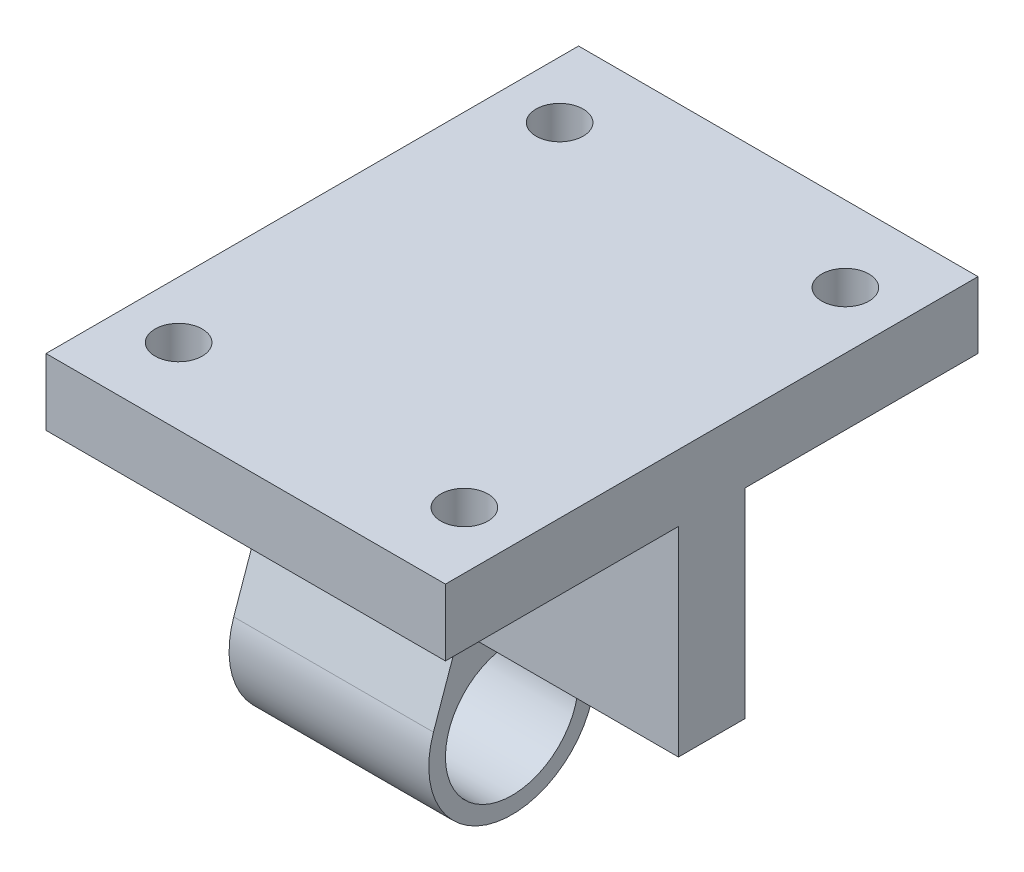
ISO-10303-21;
HEADER;
FILE_DESCRIPTION(('STEP AP214'),'2;1');
FILE_NAME('part.step','',(''),(''),'','','');
FILE_SCHEMA(('AUTOMOTIVE_DESIGN { 1 0 10303 214 1 1 1 1 }'));
ENDSEC;
DATA;
#1=APPLICATION_CONTEXT('core data for automotive mechanical design processes');
#2=APPLICATION_PROTOCOL_DEFINITION('international standard','automotive_design',2000,#1);
#3=PRODUCT_CONTEXT('',#1,'mechanical');
#4=PRODUCT('Part','Part','',(#3));
#5=PRODUCT_RELATED_PRODUCT_CATEGORY('part','',(#4));
#6=PRODUCT_DEFINITION_FORMATION('','',#4);
#7=PRODUCT_DEFINITION_CONTEXT('part definition',#1,'design');
#8=PRODUCT_DEFINITION('design','',#6,#7);
#9=PRODUCT_DEFINITION_SHAPE('','',#8);
#10=(LENGTH_UNIT() NAMED_UNIT(*) SI_UNIT(.MILLI.,.METRE.));
#11=(NAMED_UNIT(*) PLANE_ANGLE_UNIT() SI_UNIT($,.RADIAN.));
#12=(NAMED_UNIT(*) SI_UNIT($,.STERADIAN.) SOLID_ANGLE_UNIT());
#13=UNCERTAINTY_MEASURE_WITH_UNIT(LENGTH_MEASURE(1.E-05),#10,'distance_accuracy_value','');
#14=(GEOMETRIC_REPRESENTATION_CONTEXT(3) GLOBAL_UNCERTAINTY_ASSIGNED_CONTEXT((#13)) GLOBAL_UNIT_ASSIGNED_CONTEXT((#10,
#11,#12)) REPRESENTATION_CONTEXT('',''));
#15=CARTESIAN_POINT('',(0.,0.,0.));
#16=DIRECTION('',(0.,0.,1.));
#17=DIRECTION('',(1.,0.,0.));
#18=AXIS2_PLACEMENT_3D('',#15,#16,#17);
#19=CARTESIAN_POINT('',(38.1,19.05,-3.175));
#20=DIRECTION('',(0.,0.,1.));
#21=DIRECTION('',(0.,-1.,0.));
#22=AXIS2_PLACEMENT_3D('',#19,#20,#21);
#23=PLANE('',#22);
#24=DIRECTION('',(-1.,0.,0.));
#25=VECTOR('',#24,1.);
#26=CARTESIAN_POINT('',(19.05,8.08321734792888,-3.175));
#27=LINE('',#26,#25);
#28=CARTESIAN_POINT('',(19.05,8.08321734792888,-3.175));
#29=VERTEX_POINT('',#28);
#30=CARTESIAN_POINT('',(0.,8.08321734792888,-3.175));
#31=VERTEX_POINT('',#30);
#32=EDGE_CURVE('E158',#29,#31,#27,.T.);
#33=ORIENTED_EDGE('',*,*,#32,.T.);
#34=DIRECTION('',(0.,1.,0.));
#35=VECTOR('',#34,1.);
#36=CARTESIAN_POINT('',(0.,19.05,-3.175));
#37=LINE('',#36,#35);
#38=CARTESIAN_POINT('',(0.,19.05,-3.175));
#39=VERTEX_POINT('',#38);
#40=EDGE_CURVE('E194',#31,#39,#37,.T.);
#41=ORIENTED_EDGE('',*,*,#40,.T.);
#42=DIRECTION('',(-1.,0.,0.));
#43=VECTOR('',#42,1.);
#44=CARTESIAN_POINT('',(38.1,19.05,-3.175));
#45=LINE('',#44,#43);
#46=CARTESIAN_POINT('',(38.1,19.05,-3.175));
#47=VERTEX_POINT('',#46);
#48=EDGE_CURVE('E11',#47,#39,#45,.T.);
#49=ORIENTED_EDGE('',*,*,#48,.F.);
#50=DIRECTION('',(0.,1.,0.));
#51=VECTOR('',#50,1.);
#52=CARTESIAN_POINT('',(38.1,19.05,-3.175));
#53=LINE('',#52,#51);
#54=CARTESIAN_POINT('',(38.1,0.,-3.175));
#55=VERTEX_POINT('',#54);
#56=EDGE_CURVE('E201',#55,#47,#53,.T.);
#57=ORIENTED_EDGE('',*,*,#56,.F.);
#58=DIRECTION('',(-1.,0.,0.));
#59=VECTOR('',#58,1.);
#60=CARTESIAN_POINT('',(38.1,0.,-3.175));
#61=LINE('',#60,#59);
#62=CARTESIAN_POINT('',(19.05,0.,-3.175));
#63=VERTEX_POINT('',#62);
#64=EDGE_CURVE('E219',#55,#63,#61,.T.);
#65=ORIENTED_EDGE('',*,*,#64,.T.);
#66=DIRECTION('',(0.,-1.,0.));
#67=VECTOR('',#66,1.);
#68=CARTESIAN_POINT('',(19.05,0.,-3.175));
#69=LINE('',#68,#67);
#70=EDGE_CURVE('E51',#29,#63,#69,.T.);
#71=ORIENTED_EDGE('',*,*,#70,.F.);
#72=EDGE_LOOP('',(#33,#41,#49,#57,#65,#71));
#73=FACE_BOUND('',#72,.T.);
#74=ADVANCED_FACE('F35',(#73),#23,.F.);
#75=CARTESIAN_POINT('',(38.1,19.05,3.175));
#76=DIRECTION('',(0.,0.,-1.));
#77=DIRECTION('',(0.,1.,0.));
#78=AXIS2_PLACEMENT_3D('',#75,#76,#77);
#79=PLANE('',#78);
#80=DIRECTION('',(-1.,0.,0.));
#81=VECTOR('',#80,1.);
#82=CARTESIAN_POINT('',(19.05,8.08321734792888,3.175));
#83=LINE('',#82,#81);
#84=CARTESIAN_POINT('',(19.05,8.08321734792888,3.175));
#85=VERTEX_POINT('',#84);
#86=CARTESIAN_POINT('',(0.,8.08321734792888,3.175));
#87=VERTEX_POINT('',#86);
#88=EDGE_CURVE('E59',#85,#87,#83,.T.);
#89=ORIENTED_EDGE('',*,*,#88,.F.);
#90=DIRECTION('',(0.,1.,0.));
#91=VECTOR('',#90,1.);
#92=CARTESIAN_POINT('',(19.05,0.,3.175));
#93=LINE('',#92,#91);
#94=CARTESIAN_POINT('',(19.05,0.,3.175));
#95=VERTEX_POINT('',#94);
#96=EDGE_CURVE('E172',#95,#85,#93,.T.);
#97=ORIENTED_EDGE('',*,*,#96,.F.);
#98=DIRECTION('',(-1.,0.,0.));
#99=VECTOR('',#98,1.);
#100=CARTESIAN_POINT('',(38.1,0.,3.175));
#101=LINE('',#100,#99);
#102=CARTESIAN_POINT('',(38.1,0.,3.175));
#103=VERTEX_POINT('',#102);
#104=EDGE_CURVE('E233',#103,#95,#101,.T.);
#105=ORIENTED_EDGE('',*,*,#104,.F.);
#106=DIRECTION('',(0.,-1.,0.));
#107=VECTOR('',#106,1.);
#108=CARTESIAN_POINT('',(38.1,19.05,3.175));
#109=LINE('',#108,#107);
#110=CARTESIAN_POINT('',(38.1,19.05,3.175));
#111=VERTEX_POINT('',#110);
#112=EDGE_CURVE('E215',#111,#103,#109,.T.);
#113=ORIENTED_EDGE('',*,*,#112,.F.);
#114=DIRECTION('',(-1.,0.,0.));
#115=VECTOR('',#114,1.);
#116=CARTESIAN_POINT('',(38.1,19.05,3.175));
#117=LINE('',#116,#115);
#118=CARTESIAN_POINT('',(0.,19.05,3.175));
#119=VERTEX_POINT('',#118);
#120=EDGE_CURVE('E236',#111,#119,#117,.T.);
#121=ORIENTED_EDGE('',*,*,#120,.T.);
#122=DIRECTION('',(0.,-1.,0.));
#123=VECTOR('',#122,1.);
#124=CARTESIAN_POINT('',(0.,19.05,3.175));
#125=LINE('',#124,#123);
#126=EDGE_CURVE('E205',#119,#87,#125,.T.);
#127=ORIENTED_EDGE('',*,*,#126,.T.);
#128=EDGE_LOOP('',(#89,#97,#105,#113,#121,#127));
#129=FACE_BOUND('',#128,.T.);
#130=ADVANCED_FACE('F300',(#129),#79,.F.);
#131=CARTESIAN_POINT('',(38.1,0.,3.175));
#132=DIRECTION('',(0.,1.,0.));
#133=DIRECTION('',(0.,0.,1.));
#134=AXIS2_PLACEMENT_3D('',#131,#132,#133);
#135=PLANE('',#134);
#136=DIRECTION('',(0.,0.,1.));
#137=VECTOR('',#136,1.);
#138=CARTESIAN_POINT('',(19.05,0.,0.));
#139=LINE('',#138,#137);
#140=EDGE_CURVE('E174',#63,#95,#139,.T.);
#141=ORIENTED_EDGE('',*,*,#140,.F.);
#142=ORIENTED_EDGE('',*,*,#64,.F.);
#143=DIRECTION('',(0.,0.,-1.));
#144=VECTOR('',#143,1.);
#145=CARTESIAN_POINT('',(38.1,0.,3.175));
#146=LINE('',#145,#144);
#147=EDGE_CURVE('E217',#103,#55,#146,.T.);
#148=ORIENTED_EDGE('',*,*,#147,.F.);
#149=ORIENTED_EDGE('',*,*,#104,.T.);
#150=EDGE_LOOP('',(#141,#142,#148,#149));
#151=FACE_BOUND('',#150,.T.);
#152=ADVANCED_FACE('F304',(#151),#135,.F.);
#153=CARTESIAN_POINT('',(38.1,19.05,-3.175));
#154=DIRECTION('',(0.,1.,0.));
#155=DIRECTION('',(0.,0.,1.));
#156=AXIS2_PLACEMENT_3D('',#153,#154,#155);
#157=PLANE('',#156);
#158=CARTESIAN_POINT('',(32.6771,19.0500000000001,-18.1694666666667));
#159=DIRECTION('',(0.,1.,0.));
#160=DIRECTION('',(0.,0.,1.));
#161=AXIS2_PLACEMENT_3D('',#158,#159,#160);
#162=CIRCLE('',#161,2.2479);
#163=CARTESIAN_POINT('',(32.6771,19.05,-15.9215666666667));
#164=VERTEX_POINT('',#163);
#165=EDGE_CURVE('E181',#164,#164,#162,.T.);
#166=ORIENTED_EDGE('',*,*,#165,.T.);
#167=EDGE_LOOP('',(#166));
#168=FACE_BOUND('',#167,.T.);
#169=CARTESIAN_POINT('',(5.4229,19.0500000000001,-18.1694666666667));
#170=DIRECTION('',(0.,1.,0.));
#171=DIRECTION('',(0.,0.,1.));
#172=AXIS2_PLACEMENT_3D('',#169,#170,#171);
#173=CIRCLE('',#172,2.2479);
#174=CARTESIAN_POINT('',(5.4229,19.05,-15.9215666666667));
#175=VERTEX_POINT('',#174);
#176=EDGE_CURVE('E255',#175,#175,#173,.T.);
#177=ORIENTED_EDGE('',*,*,#176,.T.);
#178=EDGE_LOOP('',(#177));
#179=FACE_BOUND('',#178,.T.);
#180=DIRECTION('',(0.,0.,-1.));
#181=VECTOR('',#180,1.);
#182=CARTESIAN_POINT('',(0.,19.05,-3.175));
#183=LINE('',#182,#181);
#184=CARTESIAN_POINT('',(0.,19.0500000000001,-25.4));
#185=VERTEX_POINT('',#184);
#186=EDGE_CURVE('E221',#39,#185,#183,.T.);
#187=ORIENTED_EDGE('',*,*,#186,.T.);
#188=DIRECTION('',(-1.,0.,0.));
#189=VECTOR('',#188,1.);
#190=CARTESIAN_POINT('',(38.1,19.0500000000001,-25.4));
#191=LINE('',#190,#189);
#192=CARTESIAN_POINT('',(38.1,19.0500000000001,-25.4));
#193=VERTEX_POINT('',#192);
#194=EDGE_CURVE('E43',#193,#185,#191,.T.);
#195=ORIENTED_EDGE('',*,*,#194,.F.);
#196=DIRECTION('',(0.,0.,-1.));
#197=VECTOR('',#196,1.);
#198=CARTESIAN_POINT('',(38.1,19.05,-3.175));
#199=LINE('',#198,#197);
#200=EDGE_CURVE('E204',#47,#193,#199,.T.);
#201=ORIENTED_EDGE('',*,*,#200,.F.);
#202=ORIENTED_EDGE('',*,*,#48,.T.);
#203=EDGE_LOOP('',(#187,#195,#201,#202));
#204=FACE_BOUND('',#203,.T.);
#205=ADVANCED_FACE('F312',(#168,#179,#204),#157,.F.);
#206=CARTESIAN_POINT('',(38.1,25.4000000000001,-25.4));
#207=DIRECTION('',(0.,0.,1.));
#208=DIRECTION('',(0.,-1.,0.));
#209=AXIS2_PLACEMENT_3D('',#206,#207,#208);
#210=PLANE('',#209);
#211=DIRECTION('',(0.,1.,0.));
#212=VECTOR('',#211,1.);
#213=CARTESIAN_POINT('',(0.,25.4000000000001,-25.4));
#214=LINE('',#213,#212);
#215=CARTESIAN_POINT('',(0.,25.4000000000001,-25.4));
#216=VERTEX_POINT('',#215);
#217=EDGE_CURVE('E223',#185,#216,#214,.T.);
#218=ORIENTED_EDGE('',*,*,#217,.T.);
#219=DIRECTION('',(-1.,0.,0.));
#220=VECTOR('',#219,1.);
#221=CARTESIAN_POINT('',(38.1,25.4000000000001,-25.4));
#222=LINE('',#221,#220);
#223=CARTESIAN_POINT('',(38.1,25.4000000000001,-25.4));
#224=VERTEX_POINT('',#223);
#225=EDGE_CURVE('E245',#224,#216,#222,.T.);
#226=ORIENTED_EDGE('',*,*,#225,.F.);
#227=DIRECTION('',(0.,1.,0.));
#228=VECTOR('',#227,1.);
#229=CARTESIAN_POINT('',(38.1,25.4000000000001,-25.4));
#230=LINE('',#229,#228);
#231=EDGE_CURVE('E207',#193,#224,#230,.T.);
#232=ORIENTED_EDGE('',*,*,#231,.F.);
#233=ORIENTED_EDGE('',*,*,#194,.T.);
#234=EDGE_LOOP('',(#218,#226,#232,#233));
#235=FACE_BOUND('',#234,.T.);
#236=ADVANCED_FACE('F344',(#235),#210,.F.);
#237=CARTESIAN_POINT('',(38.1,25.4000000000001,25.4));
#238=DIRECTION('',(0.,-1.,0.));
#239=DIRECTION('',(0.,0.,-1.));
#240=AXIS2_PLACEMENT_3D('',#237,#238,#239);
#241=PLANE('',#240);
#242=CARTESIAN_POINT('',(5.4229,25.4000000000001,18.1694666666667));
#243=DIRECTION('',(0.,1.,0.));
#244=DIRECTION('',(0.,0.,1.));
#245=AXIS2_PLACEMENT_3D('',#242,#243,#244);
#246=CIRCLE('',#245,2.2479);
#247=CARTESIAN_POINT('',(5.4229,25.4000000000001,20.4173666666667));
#248=VERTEX_POINT('',#247);
#249=EDGE_CURVE('E266',#248,#248,#246,.T.);
#250=ORIENTED_EDGE('',*,*,#249,.F.);
#251=EDGE_LOOP('',(#250));
#252=FACE_BOUND('',#251,.T.);
#253=CARTESIAN_POINT('',(32.6771,25.4000000000001,18.1694666666667));
#254=DIRECTION('',(0.,1.,0.));
#255=DIRECTION('',(0.,0.,1.));
#256=AXIS2_PLACEMENT_3D('',#253,#254,#255);
#257=CIRCLE('',#256,2.2479);
#258=CARTESIAN_POINT('',(32.6771,25.4000000000001,20.4173666666667));
#259=VERTEX_POINT('',#258);
#260=EDGE_CURVE('E262',#259,#259,#257,.T.);
#261=ORIENTED_EDGE('',*,*,#260,.F.);
#262=EDGE_LOOP('',(#261));
#263=FACE_BOUND('',#262,.T.);
#264=CARTESIAN_POINT('',(32.6771,25.4000000000001,-18.1694666666667));
#265=DIRECTION('',(0.,1.,0.));
#266=DIRECTION('',(0.,0.,1.));
#267=AXIS2_PLACEMENT_3D('',#264,#265,#266);
#268=CIRCLE('',#267,2.2479);
#269=CARTESIAN_POINT('',(32.6771,25.4000000000001,-15.9215666666667));
#270=VERTEX_POINT('',#269);
#271=EDGE_CURVE('E257',#270,#270,#268,.T.);
#272=ORIENTED_EDGE('',*,*,#271,.F.);
#273=EDGE_LOOP('',(#272));
#274=FACE_BOUND('',#273,.T.);
#275=CARTESIAN_POINT('',(5.4229,25.4000000000001,-18.1694666666667));
#276=DIRECTION('',(0.,1.,0.));
#277=DIRECTION('',(0.,0.,1.));
#278=AXIS2_PLACEMENT_3D('',#275,#276,#277);
#279=CIRCLE('',#278,2.2479);
#280=CARTESIAN_POINT('',(5.4229,25.4000000000001,-15.9215666666667));
#281=VERTEX_POINT('',#280);
#282=EDGE_CURVE('E251',#281,#281,#279,.T.);
#283=ORIENTED_EDGE('',*,*,#282,.F.);
#284=EDGE_LOOP('',(#283));
#285=FACE_BOUND('',#284,.T.);
#286=DIRECTION('',(0.,0.,1.));
#287=VECTOR('',#286,1.);
#288=CARTESIAN_POINT('',(0.,25.4000000000001,25.4));
#289=LINE('',#288,#287);
#290=CARTESIAN_POINT('',(0.,25.4000000000001,25.4));
#291=VERTEX_POINT('',#290);
#292=EDGE_CURVE('E225',#216,#291,#289,.T.);
#293=ORIENTED_EDGE('',*,*,#292,.T.);
#294=DIRECTION('',(-1.,0.,0.));
#295=VECTOR('',#294,1.);
#296=CARTESIAN_POINT('',(38.1,25.4000000000001,25.4));
#297=LINE('',#296,#295);
#298=CARTESIAN_POINT('',(38.1,25.4000000000001,25.4));
#299=VERTEX_POINT('',#298);
#300=EDGE_CURVE('E242',#299,#291,#297,.T.);
#301=ORIENTED_EDGE('',*,*,#300,.F.);
#302=DIRECTION('',(0.,0.,1.));
#303=VECTOR('',#302,1.);
#304=CARTESIAN_POINT('',(38.1,25.4000000000001,25.4));
#305=LINE('',#304,#303);
#306=EDGE_CURVE('E209',#224,#299,#305,.T.);
#307=ORIENTED_EDGE('',*,*,#306,.F.);
#308=ORIENTED_EDGE('',*,*,#225,.T.);
#309=EDGE_LOOP('',(#293,#301,#307,#308));
#310=FACE_BOUND('',#309,.T.);
#311=ADVANCED_FACE('F339',(#252,#263,#274,#285,#310),#241,.F.);
#312=CARTESIAN_POINT('',(38.1,25.4000000000001,25.4));
#313=DIRECTION('',(0.,0.,-1.));
#314=DIRECTION('',(-1.,0.,0.));
#315=AXIS2_PLACEMENT_3D('',#312,#313,#314);
#316=PLANE('',#315);
#317=DIRECTION('',(0.,-1.,0.));
#318=VECTOR('',#317,1.);
#319=CARTESIAN_POINT('',(0.,25.4000000000001,25.4));
#320=LINE('',#319,#318);
#321=CARTESIAN_POINT('',(0.,19.0500000000001,25.4));
#322=VERTEX_POINT('',#321);
#323=EDGE_CURVE('E227',#291,#322,#320,.T.);
#324=ORIENTED_EDGE('',*,*,#323,.T.);
#325=DIRECTION('',(-1.,0.,0.));
#326=VECTOR('',#325,1.);
#327=CARTESIAN_POINT('',(38.1,19.0500000000001,25.4));
#328=LINE('',#327,#326);
#329=CARTESIAN_POINT('',(38.1,19.0500000000001,25.4));
#330=VERTEX_POINT('',#329);
#331=EDGE_CURVE('E239',#330,#322,#328,.T.);
#332=ORIENTED_EDGE('',*,*,#331,.F.);
#333=DIRECTION('',(0.,-1.,0.));
#334=VECTOR('',#333,1.);
#335=CARTESIAN_POINT('',(38.1,25.4000000000001,25.4));
#336=LINE('',#335,#334);
#337=EDGE_CURVE('E211',#299,#330,#336,.T.);
#338=ORIENTED_EDGE('',*,*,#337,.F.);
#339=ORIENTED_EDGE('',*,*,#300,.T.);
#340=EDGE_LOOP('',(#324,#332,#338,#339));
#341=FACE_BOUND('',#340,.T.);
#342=ADVANCED_FACE('F336',(#341),#316,.F.);
#343=CARTESIAN_POINT('',(38.1,19.05,3.175));
#344=DIRECTION('',(0.,1.,0.));
#345=DIRECTION('',(0.,0.,1.));
#346=AXIS2_PLACEMENT_3D('',#343,#344,#345);
#347=PLANE('',#346);
#348=CARTESIAN_POINT('',(5.4229,19.0500000000001,18.1694666666667));
#349=DIRECTION('',(0.,1.,0.));
#350=DIRECTION('',(0.,0.,1.));
#351=AXIS2_PLACEMENT_3D('',#348,#349,#350);
#352=CIRCLE('',#351,2.2479);
#353=CARTESIAN_POINT('',(5.4229,19.0500000000001,20.4173666666667));
#354=VERTEX_POINT('',#353);
#355=EDGE_CURVE('E38',#354,#354,#352,.T.);
#356=ORIENTED_EDGE('',*,*,#355,.T.);
#357=EDGE_LOOP('',(#356));
#358=FACE_BOUND('',#357,.T.);
#359=CARTESIAN_POINT('',(32.6771,19.0500000000001,18.1694666666667));
#360=DIRECTION('',(0.,1.,0.));
#361=DIRECTION('',(0.,0.,1.));
#362=AXIS2_PLACEMENT_3D('',#359,#360,#361);
#363=CIRCLE('',#362,2.2479);
#364=CARTESIAN_POINT('',(32.6771,19.0500000000001,20.4173666666667));
#365=VERTEX_POINT('',#364);
#366=EDGE_CURVE('E249',#365,#365,#363,.T.);
#367=ORIENTED_EDGE('',*,*,#366,.T.);
#368=EDGE_LOOP('',(#367));
#369=FACE_BOUND('',#368,.T.);
#370=DIRECTION('',(0.,0.,-1.));
#371=VECTOR('',#370,1.);
#372=CARTESIAN_POINT('',(0.,19.05,3.175));
#373=LINE('',#372,#371);
#374=EDGE_CURVE('E229',#322,#119,#373,.T.);
#375=ORIENTED_EDGE('',*,*,#374,.T.);
#376=ORIENTED_EDGE('',*,*,#120,.F.);
#377=DIRECTION('',(0.,0.,-1.));
#378=VECTOR('',#377,1.);
#379=CARTESIAN_POINT('',(38.1,19.05,3.175));
#380=LINE('',#379,#378);
#381=EDGE_CURVE('E213',#330,#111,#380,.T.);
#382=ORIENTED_EDGE('',*,*,#381,.F.);
#383=ORIENTED_EDGE('',*,*,#331,.T.);
#384=EDGE_LOOP('',(#375,#376,#382,#383));
#385=FACE_BOUND('',#384,.T.);
#386=ADVANCED_FACE('F294',(#358,#369,#385),#347,.F.);
#387=CARTESIAN_POINT('',(38.1,0.,0.));
#388=DIRECTION('',(1.,0.,0.));
#389=DIRECTION('',(0.,0.,-1.));
#390=AXIS2_PLACEMENT_3D('',#387,#388,#389);
#391=PLANE('',#390);
#392=ORIENTED_EDGE('',*,*,#56,.T.);
#393=ORIENTED_EDGE('',*,*,#200,.T.);
#394=ORIENTED_EDGE('',*,*,#231,.T.);
#395=ORIENTED_EDGE('',*,*,#306,.T.);
#396=ORIENTED_EDGE('',*,*,#337,.T.);
#397=ORIENTED_EDGE('',*,*,#381,.T.);
#398=ORIENTED_EDGE('',*,*,#112,.T.);
#399=ORIENTED_EDGE('',*,*,#147,.T.);
#400=EDGE_LOOP('',(#392,#393,#394,#395,#396,#397,#398,#399));
#401=FACE_BOUND('',#400,.T.);
#402=ADVANCED_FACE('F284',(#401),#391,.T.);
#403=CARTESIAN_POINT('',(0.,0.,0.));
#404=DIRECTION('',(1.,0.,0.));
#405=DIRECTION('',(0.,0.,-1.));
#406=AXIS2_PLACEMENT_3D('',#403,#404,#405);
#407=PLANE('',#406);
#408=ORIENTED_EDGE('',*,*,#40,.F.);
#409=CARTESIAN_POINT('',(0.,8.08321734792888,-9.525));
#410=DIRECTION('',(-1.,0.,0.));
#411=DIRECTION('',(0.,0.,1.));
#412=AXIS2_PLACEMENT_3D('',#409,#410,#411);
#413=CIRCLE('',#412,6.35);
#414=CARTESIAN_POINT('',(0.,5.98309009300287,-3.53234069772718));
#415=VERTEX_POINT('',#414);
#416=EDGE_CURVE('E180',#31,#415,#413,.F.);
#417=ORIENTED_EDGE('',*,*,#416,.T.);
#418=DIRECTION('',(0.,0.943725874373672,0.330728701563151));
#419=VECTOR('',#418,1.);
#420=CARTESIAN_POINT('',(0.,1.75694361848368,-5.01339359040223));
#421=LINE('',#420,#419);
#422=CARTESIAN_POINT('',(0.,-5.31234093134249,-7.49082412784102));
#423=VERTEX_POINT('',#422);
#424=EDGE_CURVE('E153',#423,#415,#421,.T.);
#425=ORIENTED_EDGE('',*,*,#424,.F.);
#426=CARTESIAN_POINT('',(0.,-7.9375,0.));
#427=DIRECTION('',(-1.,0.,0.));
#428=DIRECTION('',(0.,0.,1.));
#429=AXIS2_PLACEMENT_3D('',#426,#427,#428);
#430=CIRCLE('',#429,7.9375);
#431=CARTESIAN_POINT('',(0.,-5.31234093134249,7.49082412784102));
#432=VERTEX_POINT('',#431);
#433=EDGE_CURVE('E184',#423,#432,#430,.T.);
#434=ORIENTED_EDGE('',*,*,#433,.T.);
#435=DIRECTION('',(0.,0.943725874373672,-0.330728701563152));
#436=VECTOR('',#435,1.);
#437=CARTESIAN_POINT('',(0.,1.75694361848368,5.01339359040223));
#438=LINE('',#437,#436);
#439=CARTESIAN_POINT('',(0.,5.98309009300287,3.53234069772718));
#440=VERTEX_POINT('',#439);
#441=EDGE_CURVE('E187',#432,#440,#438,.T.);
#442=ORIENTED_EDGE('',*,*,#441,.T.);
#443=CARTESIAN_POINT('',(0.,8.08321734792888,9.525));
#444=DIRECTION('',(-1.,0.,0.));
#445=DIRECTION('',(0.,0.,1.));
#446=AXIS2_PLACEMENT_3D('',#443,#444,#445);
#447=CIRCLE('',#446,6.35);
#448=EDGE_CURVE('E190',#87,#440,#447,.T.);
#449=ORIENTED_EDGE('',*,*,#448,.F.);
#450=ORIENTED_EDGE('',*,*,#126,.F.);
#451=ORIENTED_EDGE('',*,*,#374,.F.);
#452=ORIENTED_EDGE('',*,*,#323,.F.);
#453=ORIENTED_EDGE('',*,*,#292,.F.);
#454=ORIENTED_EDGE('',*,*,#217,.F.);
#455=ORIENTED_EDGE('',*,*,#186,.F.);
#456=EDGE_LOOP('',(#408,#417,#425,#434,#442,#449,#450,#451,#452,#453,#454,#455));
#457=FACE_BOUND('',#456,.T.);
#458=CARTESIAN_POINT('',(0.,-7.9375,0.));
#459=DIRECTION('',(-1.,0.,0.));
#460=DIRECTION('',(0.,0.,1.));
#461=AXIS2_PLACEMENT_3D('',#458,#459,#460);
#462=CIRCLE('',#461,6.35);
#463=CARTESIAN_POINT('',(0.,-7.9375,6.35));
#464=VERTEX_POINT('',#463);
#465=EDGE_CURVE('E177',#464,#464,#462,.T.);
#466=ORIENTED_EDGE('',*,*,#465,.F.);
#467=EDGE_LOOP('',(#466));
#468=FACE_BOUND('',#467,.T.);
#469=ADVANCED_FACE('F281',(#457,#468),#407,.F.);
#470=CARTESIAN_POINT('',(19.05,8.08321734792888,9.525));
#471=DIRECTION('',(-1.,0.,0.));
#472=DIRECTION('',(0.,0.,1.));
#473=AXIS2_PLACEMENT_3D('',#470,#471,#472);
#474=CYLINDRICAL_SURFACE('',#473,6.35);
#475=ORIENTED_EDGE('',*,*,#448,.T.);
#476=DIRECTION('',(-1.,0.,0.));
#477=VECTOR('',#476,1.);
#478=CARTESIAN_POINT('',(19.05,5.98309009300287,3.53234069772718));
#479=LINE('',#478,#477);
#480=CARTESIAN_POINT('',(19.05,5.98309009300287,3.53234069772718));
#481=VERTEX_POINT('',#480);
#482=EDGE_CURVE('E195',#481,#440,#479,.T.);
#483=ORIENTED_EDGE('',*,*,#482,.F.);
#484=CARTESIAN_POINT('',(19.05,8.08321734792888,9.525));
#485=DIRECTION('',(-1.,0.,0.));
#486=DIRECTION('',(0.,0.,1.));
#487=AXIS2_PLACEMENT_3D('',#484,#485,#486);
#488=CIRCLE('',#487,6.35);
#489=EDGE_CURVE('E170',#85,#481,#488,.T.);
#490=ORIENTED_EDGE('',*,*,#489,.F.);
#491=ORIENTED_EDGE('',*,*,#88,.T.);
#492=EDGE_LOOP('',(#475,#483,#490,#491));
#493=FACE_BOUND('',#492,.T.);
#494=ADVANCED_FACE('F283',(#493),#474,.F.);
#495=CARTESIAN_POINT('',(19.05,1.75694361848368,5.01339359040223));
#496=DIRECTION('',(0.,0.330728701563152,0.943725874373672));
#497=DIRECTION('',(0.,-0.943725874373672,0.330728701563152));
#498=AXIS2_PLACEMENT_3D('',#495,#496,#497);
#499=PLANE('',#498);
#500=ORIENTED_EDGE('',*,*,#441,.F.);
#501=DIRECTION('',(-1.,0.,0.));
#502=VECTOR('',#501,1.);
#503=CARTESIAN_POINT('',(19.05,-5.31234093134249,7.49082412784102));
#504=LINE('',#503,#502);
#505=CARTESIAN_POINT('',(19.05,-5.31234093134249,7.49082412784102));
#506=VERTEX_POINT('',#505);
#507=EDGE_CURVE('E197',#506,#432,#504,.T.);
#508=ORIENTED_EDGE('',*,*,#507,.F.);
#509=DIRECTION('',(0.,0.943725874373672,-0.330728701563152));
#510=VECTOR('',#509,1.);
#511=CARTESIAN_POINT('',(19.05,1.75694361848368,5.01339359040223));
#512=LINE('',#511,#510);
#513=EDGE_CURVE('E167',#506,#481,#512,.T.);
#514=ORIENTED_EDGE('',*,*,#513,.T.);
#515=ORIENTED_EDGE('',*,*,#482,.T.);
#516=EDGE_LOOP('',(#500,#508,#514,#515));
#517=FACE_BOUND('',#516,.T.);
#518=ADVANCED_FACE('F291',(#517),#499,.T.);
#519=CARTESIAN_POINT('',(19.05,-7.9375,0.));
#520=DIRECTION('',(-1.,0.,0.));
#521=DIRECTION('',(0.,0.,1.));
#522=AXIS2_PLACEMENT_3D('',#519,#520,#521);
#523=CYLINDRICAL_SURFACE('',#522,7.9375);
#524=ORIENTED_EDGE('',*,*,#433,.F.);
#525=DIRECTION('',(-1.,0.,0.));
#526=VECTOR('',#525,1.);
#527=CARTESIAN_POINT('',(19.05,-5.31234093134249,-7.49082412784102));
#528=LINE('',#527,#526);
#529=CARTESIAN_POINT('',(19.05,-5.31234093134249,-7.49082412784102));
#530=VERTEX_POINT('',#529);
#531=EDGE_CURVE('E157',#530,#423,#528,.T.);
#532=ORIENTED_EDGE('',*,*,#531,.F.);
#533=CARTESIAN_POINT('',(19.05,-7.9375,0.));
#534=DIRECTION('',(-1.,0.,0.));
#535=DIRECTION('',(0.,0.,1.));
#536=AXIS2_PLACEMENT_3D('',#533,#534,#535);
#537=CIRCLE('',#536,7.9375);
#538=EDGE_CURVE('E146',#530,#506,#537,.T.);
#539=ORIENTED_EDGE('',*,*,#538,.T.);
#540=ORIENTED_EDGE('',*,*,#507,.T.);
#541=EDGE_LOOP('',(#524,#532,#539,#540));
#542=FACE_BOUND('',#541,.T.);
#543=ADVANCED_FACE('F326',(#542),#523,.T.);
#544=CARTESIAN_POINT('',(19.05,1.75694361848368,-5.01339359040223));
#545=DIRECTION('',(0.,-0.330728701563151,0.943725874373672));
#546=DIRECTION('',(0.,-0.943725874373672,-0.330728701563151));
#547=AXIS2_PLACEMENT_3D('',#544,#545,#546);
#548=PLANE('',#547);
#549=ORIENTED_EDGE('',*,*,#424,.T.);
#550=DIRECTION('',(-1.,0.,0.));
#551=VECTOR('',#550,1.);
#552=CARTESIAN_POINT('',(19.05,5.98309009300287,-3.53234069772718));
#553=LINE('',#552,#551);
#554=CARTESIAN_POINT('',(19.05,5.98309009300287,-3.53234069772718));
#555=VERTEX_POINT('',#554);
#556=EDGE_CURVE('E150',#555,#415,#553,.T.);
#557=ORIENTED_EDGE('',*,*,#556,.F.);
#558=DIRECTION('',(0.,0.943725874373672,0.330728701563151));
#559=VECTOR('',#558,1.);
#560=CARTESIAN_POINT('',(19.05,1.75694361848368,-5.01339359040223));
#561=LINE('',#560,#559);
#562=EDGE_CURVE('E139',#530,#555,#561,.T.);
#563=ORIENTED_EDGE('',*,*,#562,.F.);
#564=ORIENTED_EDGE('',*,*,#531,.T.);
#565=EDGE_LOOP('',(#549,#557,#563,#564));
#566=FACE_BOUND('',#565,.T.);
#567=ADVANCED_FACE('F151',(#566),#548,.F.);
#568=CARTESIAN_POINT('',(19.05,-7.9375,0.));
#569=DIRECTION('',(-1.,0.,0.));
#570=DIRECTION('',(0.,0.,1.));
#571=AXIS2_PLACEMENT_3D('',#568,#569,#570);
#572=CYLINDRICAL_SURFACE('',#571,6.35);
#573=CARTESIAN_POINT('',(19.05,-7.9375,0.));
#574=DIRECTION('',(-1.,0.,0.));
#575=DIRECTION('',(0.,0.,1.));
#576=AXIS2_PLACEMENT_3D('',#573,#574,#575);
#577=CIRCLE('',#576,6.35);
#578=CARTESIAN_POINT('',(19.05,-7.9375,6.35));
#579=VERTEX_POINT('',#578);
#580=EDGE_CURVE('E162',#579,#579,#577,.T.);
#581=ORIENTED_EDGE('',*,*,#580,.F.);
#582=EDGE_LOOP('',(#581));
#583=FACE_BOUND('',#582,.T.);
#584=ORIENTED_EDGE('',*,*,#465,.T.);
#585=EDGE_LOOP('',(#584));
#586=FACE_BOUND('',#585,.T.);
#587=ADVANCED_FACE('F275',(#583,#586),#572,.F.);
#588=CARTESIAN_POINT('',(19.05,8.08321734792888,-9.525));
#589=DIRECTION('',(-1.,0.,0.));
#590=DIRECTION('',(0.,0.,1.));
#591=AXIS2_PLACEMENT_3D('',#588,#589,#590);
#592=CYLINDRICAL_SURFACE('',#591,6.35);
#593=ORIENTED_EDGE('',*,*,#416,.F.);
#594=ORIENTED_EDGE('',*,*,#32,.F.);
#595=CARTESIAN_POINT('',(19.05,8.08321734792888,-9.525));
#596=DIRECTION('',(-1.,0.,0.));
#597=DIRECTION('',(0.,0.,1.));
#598=AXIS2_PLACEMENT_3D('',#595,#596,#597);
#599=CIRCLE('',#598,6.35);
#600=EDGE_CURVE('E143',#29,#555,#599,.F.);
#601=ORIENTED_EDGE('',*,*,#600,.T.);
#602=ORIENTED_EDGE('',*,*,#556,.T.);
#603=EDGE_LOOP('',(#593,#594,#601,#602));
#604=FACE_BOUND('',#603,.T.);
#605=ADVANCED_FACE('F160',(#604),#592,.F.);
#606=CARTESIAN_POINT('',(19.05,0.,0.));
#607=DIRECTION('',(-1.,0.,0.));
#608=DIRECTION('',(0.,0.,1.));
#609=AXIS2_PLACEMENT_3D('',#606,#607,#608);
#610=PLANE('',#609);
#611=ORIENTED_EDGE('',*,*,#580,.T.);
#612=EDGE_LOOP('',(#611));
#613=FACE_BOUND('',#612,.T.);
#614=ORIENTED_EDGE('',*,*,#70,.T.);
#615=ORIENTED_EDGE('',*,*,#140,.T.);
#616=ORIENTED_EDGE('',*,*,#96,.T.);
#617=ORIENTED_EDGE('',*,*,#489,.T.);
#618=ORIENTED_EDGE('',*,*,#513,.F.);
#619=ORIENTED_EDGE('',*,*,#538,.F.);
#620=ORIENTED_EDGE('',*,*,#562,.T.);
#621=ORIENTED_EDGE('',*,*,#600,.F.);
#622=EDGE_LOOP('',(#614,#615,#616,#617,#618,#619,#620,#621));
#623=FACE_BOUND('',#622,.T.);
#624=ADVANCED_FACE('F141',(#613,#623),#610,.F.);
#625=CARTESIAN_POINT('',(32.6771,-15.875,18.1694666666667));
#626=DIRECTION('',(0.,1.,0.));
#627=DIRECTION('',(0.,0.,1.));
#628=AXIS2_PLACEMENT_3D('',#625,#626,#627);
#629=CYLINDRICAL_SURFACE('',#628,2.2479);
#630=ORIENTED_EDGE('',*,*,#260,.T.);
#631=EDGE_LOOP('',(#630));
#632=FACE_BOUND('',#631,.T.);
#633=ORIENTED_EDGE('',*,*,#366,.F.);
#634=EDGE_LOOP('',(#633));
#635=FACE_BOUND('',#634,.T.);
#636=ADVANCED_FACE('F393',(#632,#635),#629,.F.);
#637=CARTESIAN_POINT('',(5.4229,-15.875,18.1694666666667));
#638=DIRECTION('',(0.,1.,0.));
#639=DIRECTION('',(0.,0.,1.));
#640=AXIS2_PLACEMENT_3D('',#637,#638,#639);
#641=CYLINDRICAL_SURFACE('',#640,2.2479);
#642=ORIENTED_EDGE('',*,*,#249,.T.);
#643=EDGE_LOOP('',(#642));
#644=FACE_BOUND('',#643,.T.);
#645=ORIENTED_EDGE('',*,*,#355,.F.);
#646=EDGE_LOOP('',(#645));
#647=FACE_BOUND('',#646,.T.);
#648=ADVANCED_FACE('F398',(#644,#647),#641,.F.);
#649=CARTESIAN_POINT('',(5.4229,-15.875,-18.1694666666667));
#650=DIRECTION('',(0.,1.,0.));
#651=DIRECTION('',(0.,0.,1.));
#652=AXIS2_PLACEMENT_3D('',#649,#650,#651);
#653=CYLINDRICAL_SURFACE('',#652,2.2479);
#654=ORIENTED_EDGE('',*,*,#282,.T.);
#655=EDGE_LOOP('',(#654));
#656=FACE_BOUND('',#655,.T.);
#657=ORIENTED_EDGE('',*,*,#176,.F.);
#658=EDGE_LOOP('',(#657));
#659=FACE_BOUND('',#658,.T.);
#660=ADVANCED_FACE('F408',(#656,#659),#653,.F.);
#661=CARTESIAN_POINT('',(32.6771,-15.875,-18.1694666666667));
#662=DIRECTION('',(0.,1.,0.));
#663=DIRECTION('',(0.,0.,1.));
#664=AXIS2_PLACEMENT_3D('',#661,#662,#663);
#665=CYLINDRICAL_SURFACE('',#664,2.2479);
#666=ORIENTED_EDGE('',*,*,#271,.T.);
#667=EDGE_LOOP('',(#666));
#668=FACE_BOUND('',#667,.T.);
#669=ORIENTED_EDGE('',*,*,#165,.F.);
#670=EDGE_LOOP('',(#669));
#671=FACE_BOUND('',#670,.T.);
#672=ADVANCED_FACE('F418',(#668,#671),#665,.F.);
#673=CLOSED_SHELL('',(#74,#130,#152,#205,#236,#311,#342,#386,#402,#469,#494,#518,#543,#567,#587,
#605,#624,#636,#648,#660,#672));
#674=MANIFOLD_SOLID_BREP('B2',#673);
#675=ADVANCED_BREP_SHAPE_REPRESENTATION('',(#18,#674),#14);
#676=SHAPE_DEFINITION_REPRESENTATION(#9,#675);
ENDSEC;
END-ISO-10303-21;
